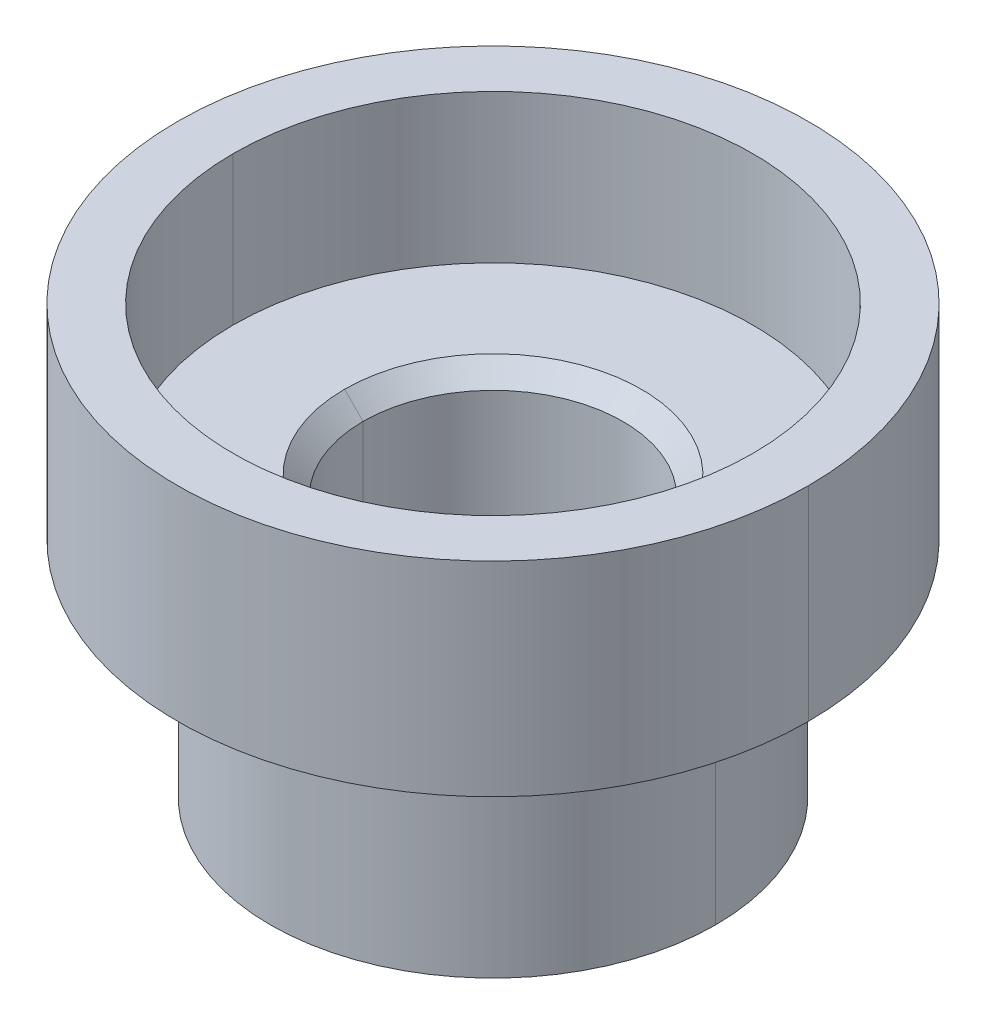
ISO-10303-21;
HEADER;
FILE_DESCRIPTION(('STEP AP214'),'2;1');
FILE_NAME('part.step','',(''),(''),'','','');
FILE_SCHEMA(('AUTOMOTIVE_DESIGN { 1 0 10303 214 1 1 1 1 }'));
ENDSEC;
DATA;
#1=APPLICATION_CONTEXT('core data for automotive mechanical design processes');
#2=APPLICATION_PROTOCOL_DEFINITION('international standard','automotive_design',2000,#1);
#3=PRODUCT_CONTEXT('',#1,'mechanical');
#4=PRODUCT('Part','Part','',(#3));
#5=PRODUCT_RELATED_PRODUCT_CATEGORY('part','',(#4));
#6=PRODUCT_DEFINITION_FORMATION('','',#4);
#7=PRODUCT_DEFINITION_CONTEXT('part definition',#1,'design');
#8=PRODUCT_DEFINITION('design','',#6,#7);
#9=PRODUCT_DEFINITION_SHAPE('','',#8);
#10=(LENGTH_UNIT() NAMED_UNIT(*) SI_UNIT(.MILLI.,.METRE.));
#11=(NAMED_UNIT(*) PLANE_ANGLE_UNIT() SI_UNIT($,.RADIAN.));
#12=(NAMED_UNIT(*) SI_UNIT($,.STERADIAN.) SOLID_ANGLE_UNIT());
#13=UNCERTAINTY_MEASURE_WITH_UNIT(LENGTH_MEASURE(1.E-05),#10,'distance_accuracy_value','');
#14=(GEOMETRIC_REPRESENTATION_CONTEXT(3) GLOBAL_UNCERTAINTY_ASSIGNED_CONTEXT((#13)) GLOBAL_UNIT_ASSIGNED_CONTEXT((#10,
#11,#12)) REPRESENTATION_CONTEXT('',''));
#15=CARTESIAN_POINT('',(0.,0.,0.));
#16=DIRECTION('',(0.,0.,1.));
#17=DIRECTION('',(1.,0.,0.));
#18=AXIS2_PLACEMENT_3D('',#15,#16,#17);
#19=CARTESIAN_POINT('',(0.,0.,0.));
#20=DIRECTION('',(0.,1.,0.));
#21=DIRECTION('',(1.,0.,0.));
#22=AXIS2_PLACEMENT_3D('',#19,#20,#21);
#23=CYLINDRICAL_SURFACE('',#22,2.8);
#24=DIRECTION('',(0.,-1.,0.));
#25=VECTOR('',#24,1.);
#26=CARTESIAN_POINT('',(2.8,0.,0.));
#27=LINE('',#26,#25);
#28=CARTESIAN_POINT('',(2.8,0.,0.));
#29=VERTEX_POINT('',#28);
#30=CARTESIAN_POINT('',(2.8,-1.6,0.));
#31=VERTEX_POINT('',#30);
#32=EDGE_CURVE('E10',#29,#31,#27,.T.);
#33=ORIENTED_EDGE('',*,*,#32,.T.);
#34=CARTESIAN_POINT('',(0.,-1.6,0.));
#35=DIRECTION('',(0.,1.,0.));
#36=DIRECTION('',(-1.,0.,0.));
#37=AXIS2_PLACEMENT_3D('',#34,#35,#36);
#38=CIRCLE('',#37,2.8);
#39=CARTESIAN_POINT('',(-2.8,-1.6,0.));
#40=VERTEX_POINT('',#39);
#41=EDGE_CURVE('E149',#40,#31,#38,.T.);
#42=ORIENTED_EDGE('',*,*,#41,.F.);
#43=DIRECTION('',(0.,-1.,0.));
#44=VECTOR('',#43,1.);
#45=CARTESIAN_POINT('',(-2.8,0.,0.));
#46=LINE('',#45,#44);
#47=CARTESIAN_POINT('',(-2.8,0.,0.));
#48=VERTEX_POINT('',#47);
#49=EDGE_CURVE('E27',#48,#40,#46,.T.);
#50=ORIENTED_EDGE('',*,*,#49,.F.);
#51=CARTESIAN_POINT('',(0.,0.,0.));
#52=DIRECTION('',(0.,1.,0.));
#53=DIRECTION('',(-1.,0.,0.));
#54=AXIS2_PLACEMENT_3D('',#51,#52,#53);
#55=CIRCLE('',#54,2.8);
#56=EDGE_CURVE('E167',#48,#29,#55,.T.);
#57=ORIENTED_EDGE('',*,*,#56,.T.);
#58=EDGE_LOOP('',(#33,#42,#50,#57));
#59=FACE_BOUND('',#58,.T.);
#60=ADVANCED_FACE('F16',(#59),#23,.F.);
#61=CARTESIAN_POINT('',(0.,0.,0.));
#62=DIRECTION('',(0.,1.,0.));
#63=DIRECTION('',(1.,0.,0.));
#64=AXIS2_PLACEMENT_3D('',#61,#62,#63);
#65=CYLINDRICAL_SURFACE('',#64,2.8);
#66=ORIENTED_EDGE('',*,*,#49,.T.);
#67=CARTESIAN_POINT('',(0.,-1.6,0.));
#68=DIRECTION('',(0.,1.,0.));
#69=DIRECTION('',(1.,0.,0.));
#70=AXIS2_PLACEMENT_3D('',#67,#68,#69);
#71=CIRCLE('',#70,2.8);
#72=EDGE_CURVE('E146',#31,#40,#71,.T.);
#73=ORIENTED_EDGE('',*,*,#72,.F.);
#74=ORIENTED_EDGE('',*,*,#32,.F.);
#75=CARTESIAN_POINT('',(0.,0.,0.));
#76=DIRECTION('',(0.,1.,0.));
#77=DIRECTION('',(1.,0.,0.));
#78=AXIS2_PLACEMENT_3D('',#75,#76,#77);
#79=CIRCLE('',#78,2.8);
#80=EDGE_CURVE('E162',#29,#48,#79,.T.);
#81=ORIENTED_EDGE('',*,*,#80,.T.);
#82=EDGE_LOOP('',(#66,#73,#74,#81));
#83=FACE_BOUND('',#82,.T.);
#84=ADVANCED_FACE('F258',(#83),#65,.F.);
#85=CARTESIAN_POINT('',(0.,-1.6,0.));
#86=DIRECTION('',(0.,1.,0.));
#87=DIRECTION('',(1.,0.,0.));
#88=AXIS2_PLACEMENT_3D('',#85,#86,#87);
#89=PLANE('',#88);
#90=CARTESIAN_POINT('',(0.,-1.6,0.));
#91=DIRECTION('',(0.,1.,0.));
#92=DIRECTION('',(-1.,0.,0.));
#93=AXIS2_PLACEMENT_3D('',#90,#91,#92);
#94=CIRCLE('',#93,1.6);
#95=CARTESIAN_POINT('',(-1.6,-1.6,0.));
#96=VERTEX_POINT('',#95);
#97=CARTESIAN_POINT('',(1.6,-1.6,0.));
#98=VERTEX_POINT('',#97);
#99=EDGE_CURVE('E113',#96,#98,#94,.T.);
#100=ORIENTED_EDGE('',*,*,#99,.F.);
#101=CARTESIAN_POINT('',(0.,-1.6,0.));
#102=DIRECTION('',(0.,1.,0.));
#103=DIRECTION('',(1.,0.,0.));
#104=AXIS2_PLACEMENT_3D('',#101,#102,#103);
#105=CIRCLE('',#104,1.6);
#106=EDGE_CURVE('E125',#98,#96,#105,.T.);
#107=ORIENTED_EDGE('',*,*,#106,.F.);
#108=EDGE_LOOP('',(#100,#107));
#109=FACE_BOUND('',#108,.T.);
#110=ORIENTED_EDGE('',*,*,#41,.T.);
#111=ORIENTED_EDGE('',*,*,#72,.T.);
#112=EDGE_LOOP('',(#110,#111));
#113=FACE_BOUND('',#112,.T.);
#114=ADVANCED_FACE('F126',(#109,#113),#89,.T.);
#115=CARTESIAN_POINT('',(0.,0.,0.));
#116=DIRECTION('',(0.,1.,0.));
#117=DIRECTION('',(1.,0.,0.));
#118=AXIS2_PLACEMENT_3D('',#115,#116,#117);
#119=CYLINDRICAL_SURFACE('',#118,1.4);
#120=DIRECTION('',(2.229359554155E-11,-1.,-6.847209824709E-11));
#121=VECTOR('',#120,1.);
#122=CARTESIAN_POINT('',(1.399999999938,-1.800000000062,1.917221036883E-10));
#123=LINE('',#122,#121);
#124=CARTESIAN_POINT('',(1.4,-1.8,0.));
#125=VERTEX_POINT('',#124);
#126=CARTESIAN_POINT('',(1.4,-4.6,0.));
#127=VERTEX_POINT('',#126);
#128=EDGE_CURVE('E141',#125,#127,#123,.T.);
#129=ORIENTED_EDGE('',*,*,#128,.T.);
#130=CARTESIAN_POINT('',(0.,-4.6,0.));
#131=DIRECTION('',(0.,1.,0.));
#132=DIRECTION('',(-1.,0.,0.));
#133=AXIS2_PLACEMENT_3D('',#130,#131,#132);
#134=CIRCLE('',#133,1.4);
#135=CARTESIAN_POINT('',(-1.4,-4.6,0.));
#136=VERTEX_POINT('',#135);
#137=EDGE_CURVE('E191',#136,#127,#134,.T.);
#138=ORIENTED_EDGE('',*,*,#137,.F.);
#139=DIRECTION('',(-2.229359554155E-11,-1.,6.847199186699E-11));
#140=VECTOR('',#139,1.);
#141=CARTESIAN_POINT('',(-1.399999999938,-1.800000000062,-1.917217486739E-10));
#142=LINE('',#141,#140);
#143=CARTESIAN_POINT('',(-1.4,-1.8,0.));
#144=VERTEX_POINT('',#143);
#145=EDGE_CURVE('E190',#144,#136,#142,.T.);
#146=ORIENTED_EDGE('',*,*,#145,.F.);
#147=CARTESIAN_POINT('',(0.,-1.8,0.));
#148=DIRECTION('',(0.,1.,0.));
#149=DIRECTION('',(-1.,0.,0.));
#150=AXIS2_PLACEMENT_3D('',#147,#148,#149);
#151=CIRCLE('',#150,1.4);
#152=EDGE_CURVE('E20',#144,#125,#151,.T.);
#153=ORIENTED_EDGE('',*,*,#152,.T.);
#154=EDGE_LOOP('',(#129,#138,#146,#153));
#155=FACE_BOUND('',#154,.T.);
#156=ADVANCED_FACE('F244',(#155),#119,.F.);
#157=CARTESIAN_POINT('',(0.,-1.700000000067,0.));
#158=DIRECTION('',(0.,1.,0.));
#159=DIRECTION('',(0.,0.,-1.));
#160=AXIS2_PLACEMENT_3D('',#157,#158,#159);
#161=CONICAL_SURFACE('',#160,1.499999999933,0.7853981633973);
#162=DIRECTION('',(-0.707106781186548,0.707106781186548,-3.55058255015424E-10));
#163=VECTOR('',#162,1.);
#164=CARTESIAN_POINT('',(-1.399999999938,-1.800000000062,-1.917217486739E-10));
#165=LINE('',#164,#163);
#166=EDGE_CURVE('E120',#144,#96,#165,.T.);
#167=ORIENTED_EDGE('',*,*,#166,.T.);
#168=ORIENTED_EDGE('',*,*,#99,.T.);
#169=DIRECTION('',(0.707106781186548,0.707106781186548,3.55057554020924E-10));
#170=VECTOR('',#169,1.);
#171=CARTESIAN_POINT('',(1.399999999938,-1.800000000062,1.917221036883E-10));
#172=LINE('',#171,#170);
#173=EDGE_CURVE('E117',#125,#98,#172,.T.);
#174=ORIENTED_EDGE('',*,*,#173,.F.);
#175=ORIENTED_EDGE('',*,*,#152,.F.);
#176=EDGE_LOOP('',(#167,#168,#174,#175));
#177=FACE_BOUND('',#176,.T.);
#178=ADVANCED_FACE('F115',(#177),#161,.F.);
#179=CARTESIAN_POINT('',(0.,-1.700000000067,0.));
#180=DIRECTION('',(0.,1.,0.));
#181=DIRECTION('',(0.,0.,-1.));
#182=AXIS2_PLACEMENT_3D('',#179,#180,#181);
#183=CONICAL_SURFACE('',#182,1.499999999933,0.7853981633973);
#184=ORIENTED_EDGE('',*,*,#173,.T.);
#185=ORIENTED_EDGE('',*,*,#106,.T.);
#186=ORIENTED_EDGE('',*,*,#166,.F.);
#187=CARTESIAN_POINT('',(0.,-1.8,0.));
#188=DIRECTION('',(0.,1.,0.));
#189=DIRECTION('',(1.,0.,0.));
#190=AXIS2_PLACEMENT_3D('',#187,#188,#189);
#191=CIRCLE('',#190,1.4);
#192=EDGE_CURVE('E133',#125,#144,#191,.T.);
#193=ORIENTED_EDGE('',*,*,#192,.F.);
#194=EDGE_LOOP('',(#184,#185,#186,#193));
#195=FACE_BOUND('',#194,.T.);
#196=ADVANCED_FACE('F131',(#195),#183,.F.);
#197=CARTESIAN_POINT('',(0.,0.,0.));
#198=DIRECTION('',(0.,1.,0.));
#199=DIRECTION('',(1.,0.,0.));
#200=AXIS2_PLACEMENT_3D('',#197,#198,#199);
#201=CYLINDRICAL_SURFACE('',#200,1.4);
#202=ORIENTED_EDGE('',*,*,#145,.T.);
#203=CARTESIAN_POINT('',(0.,-4.6,0.));
#204=DIRECTION('',(0.,1.,0.));
#205=DIRECTION('',(1.,0.,0.));
#206=AXIS2_PLACEMENT_3D('',#203,#204,#205);
#207=CIRCLE('',#206,1.4);
#208=EDGE_CURVE('E187',#127,#136,#207,.T.);
#209=ORIENTED_EDGE('',*,*,#208,.F.);
#210=ORIENTED_EDGE('',*,*,#128,.F.);
#211=ORIENTED_EDGE('',*,*,#192,.T.);
#212=EDGE_LOOP('',(#202,#209,#210,#211));
#213=FACE_BOUND('',#212,.T.);
#214=ADVANCED_FACE('F246',(#213),#201,.F.);
#215=CARTESIAN_POINT('',(0.,-4.6,0.));
#216=DIRECTION('',(0.,1.,0.));
#217=DIRECTION('',(1.,0.,0.));
#218=AXIS2_PLACEMENT_3D('',#215,#216,#217);
#219=PLANE('',#218);
#220=ORIENTED_EDGE('',*,*,#137,.T.);
#221=ORIENTED_EDGE('',*,*,#208,.T.);
#222=EDGE_LOOP('',(#220,#221));
#223=FACE_BOUND('',#222,.T.);
#224=CARTESIAN_POINT('',(0.,-4.6,0.));
#225=DIRECTION('',(0.,-1.,0.));
#226=DIRECTION('',(-1.,0.,0.));
#227=AXIS2_PLACEMENT_3D('',#224,#225,#226);
#228=CIRCLE('',#227,2.4);
#229=CARTESIAN_POINT('',(-2.4,-4.6,0.));
#230=VERTEX_POINT('',#229);
#231=CARTESIAN_POINT('',(2.4,-4.6,0.));
#232=VERTEX_POINT('',#231);
#233=EDGE_CURVE('E182',#230,#232,#228,.T.);
#234=ORIENTED_EDGE('',*,*,#233,.T.);
#235=CARTESIAN_POINT('',(0.,-4.6,0.));
#236=DIRECTION('',(0.,-1.,0.));
#237=DIRECTION('',(1.,0.,0.));
#238=AXIS2_PLACEMENT_3D('',#235,#236,#237);
#239=CIRCLE('',#238,2.4);
#240=EDGE_CURVE('E225',#232,#230,#239,.T.);
#241=ORIENTED_EDGE('',*,*,#240,.T.);
#242=EDGE_LOOP('',(#234,#241));
#243=FACE_BOUND('',#242,.T.);
#244=ADVANCED_FACE('F241',(#223,#243),#219,.F.);
#245=CARTESIAN_POINT('',(0.,-2.4,0.));
#246=DIRECTION('',(0.,-1.,0.));
#247=DIRECTION('',(-0.999978425521982,0.,-0.00656875106682888));
#248=AXIS2_PLACEMENT_3D('',#245,#246,#247);
#249=TOROIDAL_SURFACE('',#248,2.6,0.2);
#250=CARTESIAN_POINT('',(2.6,-2.4,1.109733832605E-12));
#251=DIRECTION('',(4.268209050085E-13,0.,-1.));
#252=DIRECTION('',(-1.,0.,-4.268209050085E-13));
#253=AXIS2_PLACEMENT_3D('',#250,#251,#252);
#254=CIRCLE('',#253,0.2);
#255=CARTESIAN_POINT('',(2.4,-2.4,0.));
#256=VERTEX_POINT('',#255);
#257=CARTESIAN_POINT('',(2.6,-2.2,0.));
#258=VERTEX_POINT('',#257);
#259=EDGE_CURVE('E157',#256,#258,#254,.T.);
#260=ORIENTED_EDGE('',*,*,#259,.T.);
#261=CARTESIAN_POINT('',(0.,-2.2,0.));
#262=DIRECTION('',(0.,1.,0.));
#263=DIRECTION('',(-1.,0.,0.));
#264=AXIS2_PLACEMENT_3D('',#261,#262,#263);
#265=CIRCLE('',#264,2.6);
#266=CARTESIAN_POINT('',(-2.6,-2.2,0.));
#267=VERTEX_POINT('',#266);
#268=EDGE_CURVE('E181',#267,#258,#265,.T.);
#269=ORIENTED_EDGE('',*,*,#268,.F.);
#270=CARTESIAN_POINT('',(-2.6,-2.4,-1.109789343756E-12));
#271=DIRECTION('',(-4.268417216902E-13,0.,1.));
#272=DIRECTION('',(1.,0.,4.268417216902E-13));
#273=AXIS2_PLACEMENT_3D('',#270,#271,#272);
#274=CIRCLE('',#273,0.2);
#275=CARTESIAN_POINT('',(-2.4,-2.4,0.));
#276=VERTEX_POINT('',#275);
#277=EDGE_CURVE('E158',#276,#267,#274,.T.);
#278=ORIENTED_EDGE('',*,*,#277,.F.);
#279=CARTESIAN_POINT('',(0.,-2.4,0.));
#280=DIRECTION('',(0.,1.,0.));
#281=DIRECTION('',(-1.,0.,0.));
#282=AXIS2_PLACEMENT_3D('',#279,#280,#281);
#283=CIRCLE('',#282,2.4);
#284=EDGE_CURVE('E222',#276,#256,#283,.T.);
#285=ORIENTED_EDGE('',*,*,#284,.T.);
#286=EDGE_LOOP('',(#260,#269,#278,#285));
#287=FACE_BOUND('',#286,.T.);
#288=ADVANCED_FACE('F18',(#287),#249,.F.);
#289=CARTESIAN_POINT('',(0.,-2.08,0.));
#290=DIRECTION('',(0.,-1.,0.));
#291=DIRECTION('',(-1.,0.,0.));
#292=AXIS2_PLACEMENT_3D('',#289,#290,#291);
#293=CYLINDRICAL_SURFACE('',#292,2.4);
#294=DIRECTION('',(0.,-1.,0.));
#295=VECTOR('',#294,1.);
#296=CARTESIAN_POINT('',(-2.4,-2.4,0.));
#297=LINE('',#296,#295);
#298=EDGE_CURVE('E186',#276,#230,#297,.T.);
#299=ORIENTED_EDGE('',*,*,#298,.T.);
#300=ORIENTED_EDGE('',*,*,#240,.F.);
#301=DIRECTION('',(0.,-1.,0.));
#302=VECTOR('',#301,1.);
#303=CARTESIAN_POINT('',(2.4,-2.4,0.));
#304=LINE('',#303,#302);
#305=EDGE_CURVE('E156',#256,#232,#304,.T.);
#306=ORIENTED_EDGE('',*,*,#305,.F.);
#307=ORIENTED_EDGE('',*,*,#284,.F.);
#308=EDGE_LOOP('',(#299,#300,#306,#307));
#309=FACE_BOUND('',#308,.T.);
#310=ADVANCED_FACE('F270',(#309),#293,.T.);
#311=CARTESIAN_POINT('',(0.,-2.08,0.));
#312=DIRECTION('',(0.,-1.,0.));
#313=DIRECTION('',(-1.,0.,0.));
#314=AXIS2_PLACEMENT_3D('',#311,#312,#313);
#315=CYLINDRICAL_SURFACE('',#314,2.4);
#316=ORIENTED_EDGE('',*,*,#305,.T.);
#317=ORIENTED_EDGE('',*,*,#233,.F.);
#318=ORIENTED_EDGE('',*,*,#298,.F.);
#319=CARTESIAN_POINT('',(0.,-2.4,0.));
#320=DIRECTION('',(0.,1.,0.));
#321=DIRECTION('',(1.,0.,0.));
#322=AXIS2_PLACEMENT_3D('',#319,#320,#321);
#323=CIRCLE('',#322,2.4);
#324=EDGE_CURVE('E152',#256,#276,#323,.T.);
#325=ORIENTED_EDGE('',*,*,#324,.F.);
#326=EDGE_LOOP('',(#316,#317,#318,#325));
#327=FACE_BOUND('',#326,.T.);
#328=ADVANCED_FACE('F267',(#327),#315,.T.);
#329=CARTESIAN_POINT('',(0.,-2.4,0.));
#330=DIRECTION('',(0.,-1.,0.));
#331=DIRECTION('',(0.999978425521982,0.,0.00656875106682888));
#332=AXIS2_PLACEMENT_3D('',#329,#330,#331);
#333=TOROIDAL_SURFACE('',#332,2.6,0.2);
#334=ORIENTED_EDGE('',*,*,#277,.T.);
#335=CARTESIAN_POINT('',(0.,-2.2,0.));
#336=DIRECTION('',(0.,1.,0.));
#337=DIRECTION('',(1.,0.,0.));
#338=AXIS2_PLACEMENT_3D('',#335,#336,#337);
#339=CIRCLE('',#338,2.6);
#340=EDGE_CURVE('E161',#258,#267,#339,.T.);
#341=ORIENTED_EDGE('',*,*,#340,.F.);
#342=ORIENTED_EDGE('',*,*,#259,.F.);
#343=ORIENTED_EDGE('',*,*,#324,.T.);
#344=EDGE_LOOP('',(#334,#341,#342,#343));
#345=FACE_BOUND('',#344,.T.);
#346=ADVANCED_FACE('F269',(#345),#333,.F.);
#347=CARTESIAN_POINT('',(0.,0.,0.));
#348=DIRECTION('',(0.,1.,0.));
#349=DIRECTION('',(1.,0.,0.));
#350=AXIS2_PLACEMENT_3D('',#347,#348,#349);
#351=CYLINDRICAL_SURFACE('',#350,3.4);
#352=DIRECTION('',(0.,-1.,0.));
#353=VECTOR('',#352,1.);
#354=CARTESIAN_POINT('',(3.4,0.,0.));
#355=LINE('',#354,#353);
#356=CARTESIAN_POINT('',(3.4,0.,0.));
#357=VERTEX_POINT('',#356);
#358=CARTESIAN_POINT('',(3.4,-2.2,0.));
#359=VERTEX_POINT('',#358);
#360=EDGE_CURVE('E196',#357,#359,#355,.T.);
#361=ORIENTED_EDGE('',*,*,#360,.F.);
#362=CARTESIAN_POINT('',(0.,0.,0.));
#363=DIRECTION('',(0.,1.,0.));
#364=DIRECTION('',(-1.,0.,0.));
#365=AXIS2_PLACEMENT_3D('',#362,#363,#364);
#366=CIRCLE('',#365,3.4);
#367=CARTESIAN_POINT('',(-3.4,0.,0.));
#368=VERTEX_POINT('',#367);
#369=EDGE_CURVE('E172',#368,#357,#366,.T.);
#370=ORIENTED_EDGE('',*,*,#369,.F.);
#371=DIRECTION('',(0.,-1.,0.));
#372=VECTOR('',#371,1.);
#373=CARTESIAN_POINT('',(-3.4,0.,0.));
#374=LINE('',#373,#372);
#375=CARTESIAN_POINT('',(-3.4,-2.2,0.));
#376=VERTEX_POINT('',#375);
#377=EDGE_CURVE('E166',#368,#376,#374,.T.);
#378=ORIENTED_EDGE('',*,*,#377,.T.);
#379=CARTESIAN_POINT('',(0.,-2.2,0.));
#380=DIRECTION('',(0.,1.,0.));
#381=DIRECTION('',(-1.,0.,0.));
#382=AXIS2_PLACEMENT_3D('',#379,#380,#381);
#383=CIRCLE('',#382,3.4);
#384=EDGE_CURVE('E209',#376,#359,#383,.T.);
#385=ORIENTED_EDGE('',*,*,#384,.T.);
#386=EDGE_LOOP('',(#361,#370,#378,#385));
#387=FACE_BOUND('',#386,.T.);
#388=ADVANCED_FACE('F276',(#387),#351,.T.);
#389=CARTESIAN_POINT('',(0.,-2.2,0.));
#390=DIRECTION('',(0.,-1.,0.));
#391=DIRECTION('',(0.,0.,-1.));
#392=AXIS2_PLACEMENT_3D('',#389,#390,#391);
#393=PLANE('',#392);
#394=ORIENTED_EDGE('',*,*,#268,.T.);
#395=ORIENTED_EDGE('',*,*,#340,.T.);
#396=EDGE_LOOP('',(#394,#395));
#397=FACE_BOUND('',#396,.T.);
#398=ORIENTED_EDGE('',*,*,#384,.F.);
#399=CARTESIAN_POINT('',(0.,-2.2,0.));
#400=DIRECTION('',(0.,1.,0.));
#401=DIRECTION('',(1.,0.,0.));
#402=AXIS2_PLACEMENT_3D('',#399,#400,#401);
#403=CIRCLE('',#402,3.4);
#404=EDGE_CURVE('E206',#359,#376,#403,.T.);
#405=ORIENTED_EDGE('',*,*,#404,.F.);
#406=EDGE_LOOP('',(#398,#405));
#407=FACE_BOUND('',#406,.T.);
#408=ADVANCED_FACE('F304',(#397,#407),#393,.T.);
#409=CARTESIAN_POINT('',(0.,0.,0.));
#410=DIRECTION('',(0.,1.,0.));
#411=DIRECTION('',(1.,0.,0.));
#412=AXIS2_PLACEMENT_3D('',#409,#410,#411);
#413=CYLINDRICAL_SURFACE('',#412,3.4);
#414=ORIENTED_EDGE('',*,*,#377,.F.);
#415=CARTESIAN_POINT('',(0.,0.,0.));
#416=DIRECTION('',(0.,1.,0.));
#417=DIRECTION('',(1.,0.,0.));
#418=AXIS2_PLACEMENT_3D('',#415,#416,#417);
#419=CIRCLE('',#418,3.4);
#420=EDGE_CURVE('E168',#357,#368,#419,.T.);
#421=ORIENTED_EDGE('',*,*,#420,.F.);
#422=ORIENTED_EDGE('',*,*,#360,.T.);
#423=ORIENTED_EDGE('',*,*,#404,.T.);
#424=EDGE_LOOP('',(#414,#421,#422,#423));
#425=FACE_BOUND('',#424,.T.);
#426=ADVANCED_FACE('F307',(#425),#413,.T.);
#427=CARTESIAN_POINT('',(0.,0.,0.));
#428=DIRECTION('',(0.,1.,0.));
#429=DIRECTION('',(1.,0.,0.));
#430=AXIS2_PLACEMENT_3D('',#427,#428,#429);
#431=PLANE('',#430);
#432=ORIENTED_EDGE('',*,*,#56,.F.);
#433=ORIENTED_EDGE('',*,*,#80,.F.);
#434=EDGE_LOOP('',(#432,#433));
#435=FACE_BOUND('',#434,.T.);
#436=ORIENTED_EDGE('',*,*,#369,.T.);
#437=ORIENTED_EDGE('',*,*,#420,.T.);
#438=EDGE_LOOP('',(#436,#437));
#439=FACE_BOUND('',#438,.T.);
#440=ADVANCED_FACE('F296',(#435,#439),#431,.T.);
#441=CLOSED_SHELL('',(#60,#84,#114,#156,#178,#196,#214,#244,#288,#310,#328,#346,#388,#408,#426,#440));
#442=MANIFOLD_SOLID_BREP('B1',#441);
#443=ADVANCED_BREP_SHAPE_REPRESENTATION('',(#18,#442),#14);
#444=SHAPE_DEFINITION_REPRESENTATION(#9,#443);
ENDSEC;
END-ISO-10303-21;
